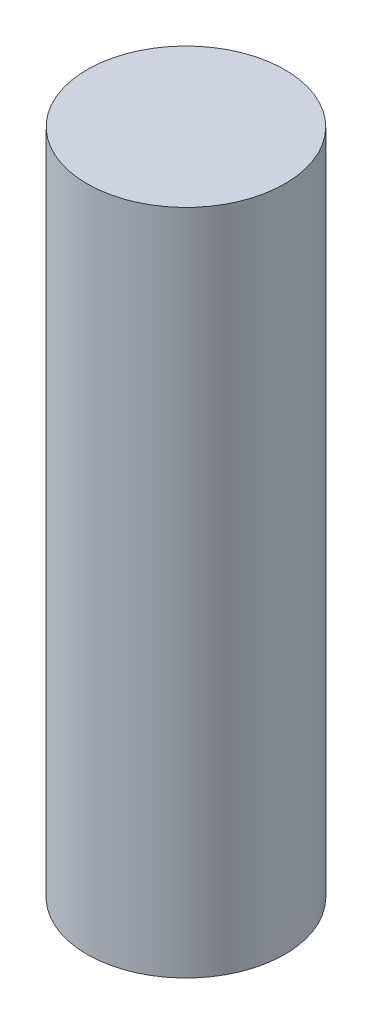
ISO-10303-21;
HEADER;
FILE_DESCRIPTION(('STEP AP214'),'2;1');
FILE_NAME('part.step','',(''),(''),'','','');
FILE_SCHEMA(('AUTOMOTIVE_DESIGN { 1 0 10303 214 1 1 1 1 }'));
ENDSEC;
DATA;
#1=APPLICATION_CONTEXT('core data for automotive mechanical design processes');
#2=APPLICATION_PROTOCOL_DEFINITION('international standard','automotive_design',2000,#1);
#3=PRODUCT_CONTEXT('',#1,'mechanical');
#4=PRODUCT('Part','Part','',(#3));
#5=PRODUCT_RELATED_PRODUCT_CATEGORY('part','',(#4));
#6=PRODUCT_DEFINITION_FORMATION('','',#4);
#7=PRODUCT_DEFINITION_CONTEXT('part definition',#1,'design');
#8=PRODUCT_DEFINITION('design','',#6,#7);
#9=PRODUCT_DEFINITION_SHAPE('','',#8);
#10=(LENGTH_UNIT() NAMED_UNIT(*) SI_UNIT(.MILLI.,.METRE.));
#11=(NAMED_UNIT(*) PLANE_ANGLE_UNIT() SI_UNIT($,.RADIAN.));
#12=(NAMED_UNIT(*) SI_UNIT($,.STERADIAN.) SOLID_ANGLE_UNIT());
#13=UNCERTAINTY_MEASURE_WITH_UNIT(LENGTH_MEASURE(1.E-05),#10,'distance_accuracy_value','');
#14=(GEOMETRIC_REPRESENTATION_CONTEXT(3) GLOBAL_UNCERTAINTY_ASSIGNED_CONTEXT((#13)) GLOBAL_UNIT_ASSIGNED_CONTEXT((#10,
#11,#12)) REPRESENTATION_CONTEXT('',''));
#15=CARTESIAN_POINT('',(0.,0.,0.));
#16=DIRECTION('',(0.,0.,1.));
#17=DIRECTION('',(1.,0.,0.));
#18=AXIS2_PLACEMENT_3D('',#15,#16,#17);
#19=CARTESIAN_POINT('',(0.,13.5,0.));
#20=DIRECTION('',(0.,-1.,0.));
#21=DIRECTION('',(0.,0.,-1.));
#22=AXIS2_PLACEMENT_3D('',#19,#20,#21);
#23=CYLINDRICAL_SURFACE('',#22,4.);
#24=CARTESIAN_POINT('',(0.,13.5,0.));
#25=DIRECTION('',(0.,1.,0.));
#26=DIRECTION('',(0.,0.,1.));
#27=AXIS2_PLACEMENT_3D('',#24,#25,#26);
#28=CIRCLE('',#27,4.);
#29=CARTESIAN_POINT('',(0.,13.5,4.));
#30=VERTEX_POINT('',#29);
#31=EDGE_CURVE('E10',#30,#30,#28,.T.);
#32=ORIENTED_EDGE('',*,*,#31,.F.);
#33=EDGE_LOOP('',(#32));
#34=FACE_BOUND('',#33,.T.);
#35=CARTESIAN_POINT('',(0.,-13.5,0.));
#36=DIRECTION('',(0.,1.,0.));
#37=DIRECTION('',(0.,0.,1.));
#38=AXIS2_PLACEMENT_3D('',#35,#36,#37);
#39=CIRCLE('',#38,4.);
#40=CARTESIAN_POINT('',(0.,-13.5,4.));
#41=VERTEX_POINT('',#40);
#42=EDGE_CURVE('E42',#41,#41,#39,.T.);
#43=ORIENTED_EDGE('',*,*,#42,.T.);
#44=EDGE_LOOP('',(#43));
#45=FACE_BOUND('',#44,.T.);
#46=ADVANCED_FACE('F39',(#34,#45),#23,.T.);
#47=CARTESIAN_POINT('',(0.,13.5,0.));
#48=DIRECTION('',(0.,1.,0.));
#49=DIRECTION('',(0.,0.,1.));
#50=AXIS2_PLACEMENT_3D('',#47,#48,#49);
#51=PLANE('',#50);
#52=ORIENTED_EDGE('',*,*,#31,.T.);
#53=EDGE_LOOP('',(#52));
#54=FACE_BOUND('',#53,.T.);
#55=ADVANCED_FACE('F54',(#54),#51,.T.);
#56=CARTESIAN_POINT('',(0.,-13.5,0.));
#57=DIRECTION('',(0.,1.,0.));
#58=DIRECTION('',(0.,0.,1.));
#59=AXIS2_PLACEMENT_3D('',#56,#57,#58);
#60=PLANE('',#59);
#61=ORIENTED_EDGE('',*,*,#42,.F.);
#62=EDGE_LOOP('',(#61));
#63=FACE_BOUND('',#62,.T.);
#64=ADVANCED_FACE('F52',(#63),#60,.F.);
#65=CLOSED_SHELL('',(#46,#55,#64));
#66=MANIFOLD_SOLID_BREP('B2',#65);
#67=ADVANCED_BREP_SHAPE_REPRESENTATION('',(#18,#66),#14);
#68=SHAPE_DEFINITION_REPRESENTATION(#9,#67);
ENDSEC;
END-ISO-10303-21;
